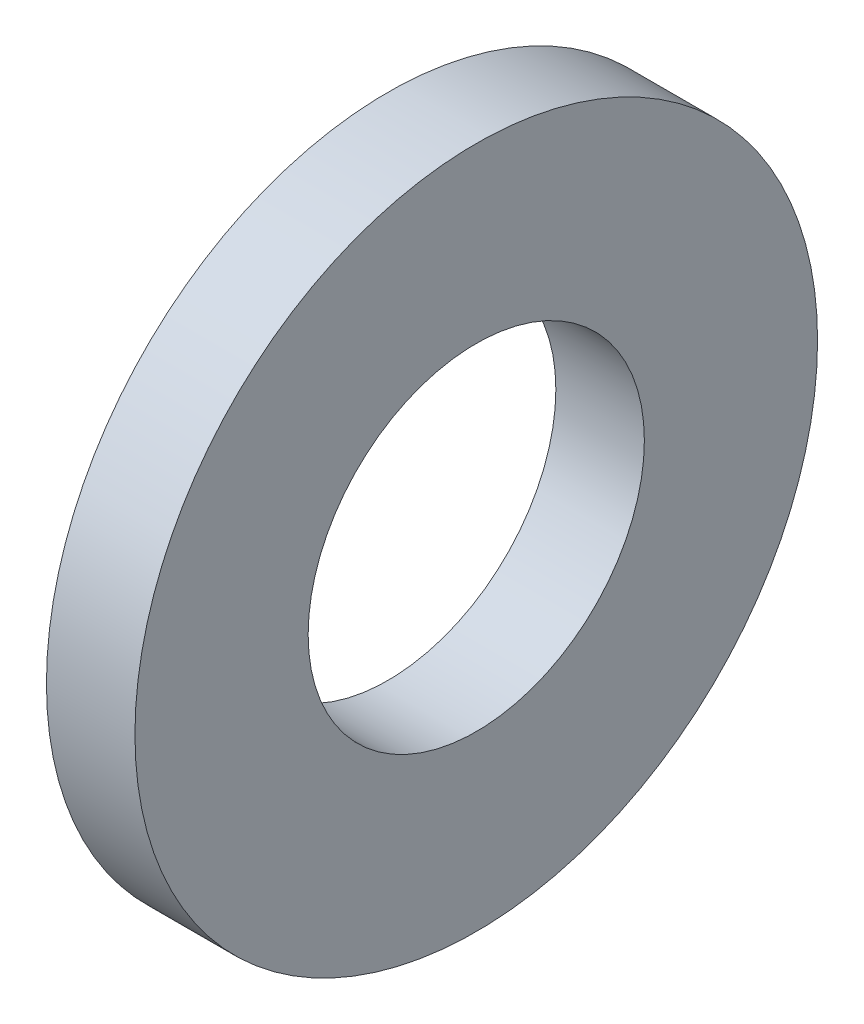
ISO-10303-21;
HEADER;
FILE_DESCRIPTION(('STEP AP214'),'2;1');
FILE_NAME('part.step','',(''),(''),'','','');
FILE_SCHEMA(('AUTOMOTIVE_DESIGN { 1 0 10303 214 1 1 1 1 }'));
ENDSEC;
DATA;
#1=APPLICATION_CONTEXT('core data for automotive mechanical design processes');
#2=APPLICATION_PROTOCOL_DEFINITION('international standard','automotive_design',2000,#1);
#3=PRODUCT_CONTEXT('',#1,'mechanical');
#4=PRODUCT('Part','Part','',(#3));
#5=PRODUCT_RELATED_PRODUCT_CATEGORY('part','',(#4));
#6=PRODUCT_DEFINITION_FORMATION('','',#4);
#7=PRODUCT_DEFINITION_CONTEXT('part definition',#1,'design');
#8=PRODUCT_DEFINITION('design','',#6,#7);
#9=PRODUCT_DEFINITION_SHAPE('','',#8);
#10=(LENGTH_UNIT() NAMED_UNIT(*) SI_UNIT(.MILLI.,.METRE.));
#11=(NAMED_UNIT(*) PLANE_ANGLE_UNIT() SI_UNIT($,.RADIAN.));
#12=(NAMED_UNIT(*) SI_UNIT($,.STERADIAN.) SOLID_ANGLE_UNIT());
#13=UNCERTAINTY_MEASURE_WITH_UNIT(LENGTH_MEASURE(1.E-05),#10,'distance_accuracy_value','');
#14=(GEOMETRIC_REPRESENTATION_CONTEXT(3) GLOBAL_UNCERTAINTY_ASSIGNED_CONTEXT((#13)) GLOBAL_UNIT_ASSIGNED_CONTEXT((#10,
#11,#12)) REPRESENTATION_CONTEXT('',''));
#15=CARTESIAN_POINT('',(0.,0.,0.));
#16=DIRECTION('',(0.,0.,1.));
#17=DIRECTION('',(1.,0.,0.));
#18=AXIS2_PLACEMENT_3D('',#15,#16,#17);
#19=CARTESIAN_POINT('',(4.4196,0.,0.));
#20=DIRECTION('',(1.,0.,0.));
#21=DIRECTION('',(0.,0.,-1.));
#22=AXIS2_PLACEMENT_3D('',#19,#20,#21);
#23=PLANE('',#22);
#24=CARTESIAN_POINT('',(4.4196,0.,0.));
#25=DIRECTION('',(1.,0.,0.));
#26=DIRECTION('',(0.,0.,-1.));
#27=AXIS2_PLACEMENT_3D('',#24,#25,#26);
#28=CIRCLE('',#27,17.0434);
#29=CARTESIAN_POINT('',(4.4196,0.,-17.0434));
#30=VERTEX_POINT('',#29);
#31=EDGE_CURVE('E10',#30,#30,#28,.T.);
#32=ORIENTED_EDGE('',*,*,#31,.T.);
#33=EDGE_LOOP('',(#32));
#34=FACE_BOUND('',#33,.T.);
#35=CARTESIAN_POINT('',(4.4196,0.,0.));
#36=DIRECTION('',(1.,0.,0.));
#37=DIRECTION('',(0.,0.,-1.));
#38=AXIS2_PLACEMENT_3D('',#35,#36,#37);
#39=CIRCLE('',#38,8.3947);
#40=CARTESIAN_POINT('',(4.4196,0.,-8.3947));
#41=VERTEX_POINT('',#40);
#42=EDGE_CURVE('E41',#41,#41,#39,.T.);
#43=ORIENTED_EDGE('',*,*,#42,.F.);
#44=EDGE_LOOP('',(#43));
#45=FACE_BOUND('',#44,.T.);
#46=ADVANCED_FACE('F30',(#34,#45),#23,.T.);
#47=CARTESIAN_POINT('',(0.,0.,0.));
#48=DIRECTION('',(1.,0.,0.));
#49=DIRECTION('',(0.,0.,-1.));
#50=AXIS2_PLACEMENT_3D('',#47,#48,#49);
#51=PLANE('',#50);
#52=CARTESIAN_POINT('',(0.,0.,0.));
#53=DIRECTION('',(1.,0.,0.));
#54=DIRECTION('',(0.,0.,-1.));
#55=AXIS2_PLACEMENT_3D('',#52,#53,#54);
#56=CIRCLE('',#55,17.0434);
#57=CARTESIAN_POINT('',(0.,0.,-17.0434));
#58=VERTEX_POINT('',#57);
#59=EDGE_CURVE('E34',#58,#58,#56,.T.);
#60=ORIENTED_EDGE('',*,*,#59,.F.);
#61=EDGE_LOOP('',(#60));
#62=FACE_BOUND('',#61,.T.);
#63=CARTESIAN_POINT('',(0.,0.,0.));
#64=DIRECTION('',(1.,0.,0.));
#65=DIRECTION('',(0.,0.,-1.));
#66=AXIS2_PLACEMENT_3D('',#63,#64,#65);
#67=CIRCLE('',#66,8.3947);
#68=CARTESIAN_POINT('',(0.,0.,-8.3947));
#69=VERTEX_POINT('',#68);
#70=EDGE_CURVE('E43',#69,#69,#67,.T.);
#71=ORIENTED_EDGE('',*,*,#70,.T.);
#72=EDGE_LOOP('',(#71));
#73=FACE_BOUND('',#72,.T.);
#74=ADVANCED_FACE('F53',(#62,#73),#51,.F.);
#75=CARTESIAN_POINT('',(4.4196,0.,0.));
#76=DIRECTION('',(-1.,0.,0.));
#77=DIRECTION('',(0.,0.,1.));
#78=AXIS2_PLACEMENT_3D('',#75,#76,#77);
#79=CYLINDRICAL_SURFACE('',#78,17.0434);
#80=ORIENTED_EDGE('',*,*,#31,.F.);
#81=EDGE_LOOP('',(#80));
#82=FACE_BOUND('',#81,.T.);
#83=ORIENTED_EDGE('',*,*,#59,.T.);
#84=EDGE_LOOP('',(#83));
#85=FACE_BOUND('',#84,.T.);
#86=ADVANCED_FACE('F32',(#82,#85),#79,.T.);
#87=CARTESIAN_POINT('',(4.4196,0.,0.));
#88=DIRECTION('',(-1.,0.,0.));
#89=DIRECTION('',(0.,0.,1.));
#90=AXIS2_PLACEMENT_3D('',#87,#88,#89);
#91=CYLINDRICAL_SURFACE('',#90,8.3947);
#92=ORIENTED_EDGE('',*,*,#42,.T.);
#93=EDGE_LOOP('',(#92));
#94=FACE_BOUND('',#93,.T.);
#95=ORIENTED_EDGE('',*,*,#70,.F.);
#96=EDGE_LOOP('',(#95));
#97=FACE_BOUND('',#96,.T.);
#98=ADVANCED_FACE('F49',(#94,#97),#91,.F.);
#99=CLOSED_SHELL('',(#46,#74,#86,#98));
#100=MANIFOLD_SOLID_BREP('B2',#99);
#101=ADVANCED_BREP_SHAPE_REPRESENTATION('',(#18,#100),#14);
#102=SHAPE_DEFINITION_REPRESENTATION(#9,#101);
ENDSEC;
END-ISO-10303-21;
